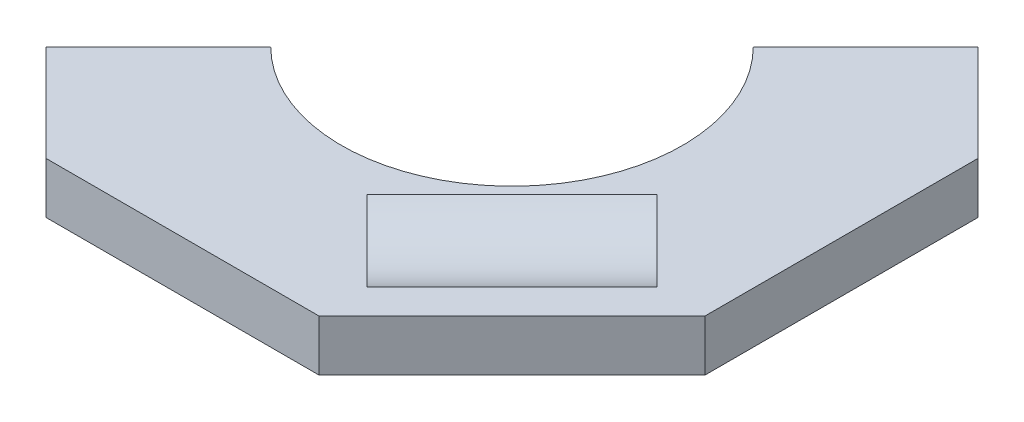
ISO-10303-21;
HEADER;
FILE_DESCRIPTION(('STEP AP214'),'2;1');
FILE_NAME('part.step','',(''),(''),'','','');
FILE_SCHEMA(('AUTOMOTIVE_DESIGN { 1 0 10303 214 1 1 1 1 }'));
ENDSEC;
DATA;
#1=APPLICATION_CONTEXT('core data for automotive mechanical design processes');
#2=APPLICATION_PROTOCOL_DEFINITION('international standard','automotive_design',2000,#1);
#3=PRODUCT_CONTEXT('',#1,'mechanical');
#4=PRODUCT('Part','Part','',(#3));
#5=PRODUCT_RELATED_PRODUCT_CATEGORY('part','',(#4));
#6=PRODUCT_DEFINITION_FORMATION('','',#4);
#7=PRODUCT_DEFINITION_CONTEXT('part definition',#1,'design');
#8=PRODUCT_DEFINITION('design','',#6,#7);
#9=PRODUCT_DEFINITION_SHAPE('','',#8);
#10=(LENGTH_UNIT() NAMED_UNIT(*) SI_UNIT(.MILLI.,.METRE.));
#11=(NAMED_UNIT(*) PLANE_ANGLE_UNIT() SI_UNIT($,.RADIAN.));
#12=(NAMED_UNIT(*) SI_UNIT($,.STERADIAN.) SOLID_ANGLE_UNIT());
#13=UNCERTAINTY_MEASURE_WITH_UNIT(LENGTH_MEASURE(1.E-05),#10,'distance_accuracy_value','');
#14=(GEOMETRIC_REPRESENTATION_CONTEXT(3) GLOBAL_UNCERTAINTY_ASSIGNED_CONTEXT((#13)) GLOBAL_UNIT_ASSIGNED_CONTEXT((#10,
#11,#12)) REPRESENTATION_CONTEXT('',''));
#15=CARTESIAN_POINT('',(0.,0.,0.));
#16=DIRECTION('',(0.,0.,1.));
#17=DIRECTION('',(1.,0.,0.));
#18=AXIS2_PLACEMENT_3D('',#15,#16,#17);
#19=CARTESIAN_POINT('',(-86.7210244842766,-0.00999999999999959,86.7210244842766));
#20=DIRECTION('',(0.707106781186547,0.,0.707106781186548));
#21=DIRECTION('',(0.707106781186548,0.,-0.707106781186547));
#22=AXIS2_PLACEMENT_3D('',#19,#20,#21);
#23=PLANE('',#22);
#24=DIRECTION('',(0.,1.,0.));
#25=VECTOR('',#24,1.);
#26=CARTESIAN_POINT('',(44.9012806053458,0.,-44.9012806053457));
#27=LINE('',#26,#25);
#28=CARTESIAN_POINT('',(44.9012806053458,19.05,-44.9012806053457));
#29=VERTEX_POINT('',#28);
#30=CARTESIAN_POINT('',(44.9012806053458,0.,-44.9012806053457));
#31=VERTEX_POINT('',#30);
#32=EDGE_CURVE('E138',#29,#31,#27,.F.);
#33=ORIENTED_EDGE('',*,*,#32,.F.);
#34=DIRECTION('',(0.707106781186548,0.,-0.707106781186547));
#35=VECTOR('',#34,1.);
#36=CARTESIAN_POINT('',(0.,19.05,0.));
#37=LINE('',#36,#35);
#38=CARTESIAN_POINT('',(86.7210244842766,19.05,-86.7210244842766));
#39=VERTEX_POINT('',#38);
#40=EDGE_CURVE('E116',#29,#39,#37,.T.);
#41=ORIENTED_EDGE('',*,*,#40,.T.);
#42=DIRECTION('',(0.,1.,0.));
#43=VECTOR('',#42,1.);
#44=CARTESIAN_POINT('',(86.7210244842766,19.05,-86.7210244842766));
#45=LINE('',#44,#43);
#46=CARTESIAN_POINT('',(86.7210244842766,0.,-86.7210244842766));
#47=VERTEX_POINT('',#46);
#48=EDGE_CURVE('E56',#47,#39,#45,.T.);
#49=ORIENTED_EDGE('',*,*,#48,.F.);
#50=DIRECTION('',(0.707106781186548,0.,-0.707106781186547));
#51=VECTOR('',#50,1.);
#52=CARTESIAN_POINT('',(0.,0.,0.));
#53=LINE('',#52,#51);
#54=EDGE_CURVE('E132',#31,#47,#53,.T.);
#55=ORIENTED_EDGE('',*,*,#54,.F.);
#56=EDGE_LOOP('',(#33,#41,#49,#55));
#57=FACE_BOUND('',#56,.T.);
#58=ADVANCED_FACE('F35',(#57),#23,.F.);
#59=DIRECTION('',(0.,-1.,0.));
#60=VECTOR('',#59,1.);
#61=CARTESIAN_POINT('',(-86.7210244842766,19.05,86.7210244842766));
#62=LINE('',#61,#60);
#63=CARTESIAN_POINT('',(-86.7210244842766,19.05,86.7210244842766));
#64=VERTEX_POINT('',#63);
#65=CARTESIAN_POINT('',(-86.7210244842766,0.,86.7210244842766));
#66=VERTEX_POINT('',#65);
#67=EDGE_CURVE('E131',#64,#66,#62,.T.);
#68=ORIENTED_EDGE('',*,*,#67,.F.);
#69=CARTESIAN_POINT('',(-44.9012806053458,19.05,44.9012806053458));
#70=VERTEX_POINT('',#69);
#71=EDGE_CURVE('E134',#64,#70,#37,.T.);
#72=ORIENTED_EDGE('',*,*,#71,.T.);
#73=DIRECTION('',(0.,1.,0.));
#74=VECTOR('',#73,1.);
#75=CARTESIAN_POINT('',(-44.9012806053458,0.,44.9012806053458));
#76=LINE('',#75,#74);
#77=CARTESIAN_POINT('',(-44.9012806053458,0.,44.9012806053458));
#78=VERTEX_POINT('',#77);
#79=EDGE_CURVE('E141',#78,#70,#76,.T.);
#80=ORIENTED_EDGE('',*,*,#79,.F.);
#81=EDGE_CURVE('E129',#66,#78,#53,.T.);
#82=ORIENTED_EDGE('',*,*,#81,.F.);
#83=EDGE_LOOP('',(#68,#72,#80,#82));
#84=FACE_BOUND('',#83,.T.);
#85=ADVANCED_FACE('F197',(#84),#23,.F.);
#86=CARTESIAN_POINT('',(-50.8,19.05,122.642048968553));
#87=DIRECTION('',(0.,0.,-1.));
#88=DIRECTION('',(-1.,0.,0.));
#89=AXIS2_PLACEMENT_3D('',#86,#87,#88);
#90=PLANE('',#89);
#91=DIRECTION('',(1.,0.,0.));
#92=VECTOR('',#91,1.);
#93=CARTESIAN_POINT('',(-50.8,0.,122.642048968553));
#94=LINE('',#93,#92);
#95=CARTESIAN_POINT('',(-50.8,0.,122.642048968553));
#96=VERTEX_POINT('',#95);
#97=CARTESIAN_POINT('',(50.8,0.,122.642048968553));
#98=VERTEX_POINT('',#97);
#99=EDGE_CURVE('E156',#96,#98,#94,.T.);
#100=ORIENTED_EDGE('',*,*,#99,.T.);
#101=DIRECTION('',(0.,-1.,0.));
#102=VECTOR('',#101,1.);
#103=CARTESIAN_POINT('',(50.8,19.05,122.642048968553));
#104=LINE('',#103,#102);
#105=CARTESIAN_POINT('',(50.8,19.05,122.642048968553));
#106=VERTEX_POINT('',#105);
#107=EDGE_CURVE('E152',#106,#98,#104,.T.);
#108=ORIENTED_EDGE('',*,*,#107,.F.);
#109=DIRECTION('',(1.,0.,0.));
#110=VECTOR('',#109,1.);
#111=CARTESIAN_POINT('',(-50.8,19.05,122.642048968553));
#112=LINE('',#111,#110);
#113=CARTESIAN_POINT('',(-50.8,19.05,122.642048968553));
#114=VERTEX_POINT('',#113);
#115=EDGE_CURVE('E155',#114,#106,#112,.T.);
#116=ORIENTED_EDGE('',*,*,#115,.F.);
#117=DIRECTION('',(0.,-1.,0.));
#118=VECTOR('',#117,1.);
#119=CARTESIAN_POINT('',(-50.8,19.05,122.642048968553));
#120=LINE('',#119,#118);
#121=EDGE_CURVE('E149',#114,#96,#120,.T.);
#122=ORIENTED_EDGE('',*,*,#121,.T.);
#123=EDGE_LOOP('',(#100,#108,#116,#122));
#124=FACE_BOUND('',#123,.T.);
#125=ADVANCED_FACE('F195',(#124),#90,.F.);
#126=CARTESIAN_POINT('',(50.8,19.05,122.642048968553));
#127=DIRECTION('',(-0.707106781186547,0.,-0.707106781186548));
#128=DIRECTION('',(-0.707106781186548,0.,0.707106781186547));
#129=AXIS2_PLACEMENT_3D('',#126,#127,#128);
#130=PLANE('',#129);
#131=DIRECTION('',(0.707106781186548,0.,-0.707106781186547));
#132=VECTOR('',#131,1.);
#133=CARTESIAN_POINT('',(50.8,0.,122.642048968553));
#134=LINE('',#133,#132);
#135=CARTESIAN_POINT('',(122.642048968553,0.,50.8000000000001));
#136=VERTEX_POINT('',#135);
#137=EDGE_CURVE('E165',#98,#136,#134,.T.);
#138=ORIENTED_EDGE('',*,*,#137,.T.);
#139=DIRECTION('',(0.,-1.,0.));
#140=VECTOR('',#139,1.);
#141=CARTESIAN_POINT('',(122.642048968553,19.05,50.8000000000001));
#142=LINE('',#141,#140);
#143=CARTESIAN_POINT('',(122.642048968553,19.05,50.8000000000001));
#144=VERTEX_POINT('',#143);
#145=EDGE_CURVE('E143',#144,#136,#142,.T.);
#146=ORIENTED_EDGE('',*,*,#145,.F.);
#147=DIRECTION('',(0.707106781186548,0.,-0.707106781186547));
#148=VECTOR('',#147,1.);
#149=CARTESIAN_POINT('',(50.8,19.05,122.642048968553));
#150=LINE('',#149,#148);
#151=EDGE_CURVE('E158',#106,#144,#150,.T.);
#152=ORIENTED_EDGE('',*,*,#151,.F.);
#153=ORIENTED_EDGE('',*,*,#107,.T.);
#154=EDGE_LOOP('',(#138,#146,#152,#153));
#155=FACE_BOUND('',#154,.T.);
#156=ADVANCED_FACE('F229',(#155),#130,.F.);
#157=CARTESIAN_POINT('',(122.642048968553,19.05,50.8000000000001));
#158=DIRECTION('',(-1.,0.,0.));
#159=DIRECTION('',(0.,0.,1.));
#160=AXIS2_PLACEMENT_3D('',#157,#158,#159);
#161=PLANE('',#160);
#162=DIRECTION('',(0.,0.,-1.));
#163=VECTOR('',#162,1.);
#164=CARTESIAN_POINT('',(122.642048968553,0.,50.8000000000001));
#165=LINE('',#164,#163);
#166=CARTESIAN_POINT('',(122.642048968553,0.,-50.8));
#167=VERTEX_POINT('',#166);
#168=EDGE_CURVE('E163',#136,#167,#165,.T.);
#169=ORIENTED_EDGE('',*,*,#168,.T.);
#170=DIRECTION('',(0.,-1.,0.));
#171=VECTOR('',#170,1.);
#172=CARTESIAN_POINT('',(122.642048968553,19.05,-50.8));
#173=LINE('',#172,#171);
#174=CARTESIAN_POINT('',(122.642048968553,19.05,-50.8));
#175=VERTEX_POINT('',#174);
#176=EDGE_CURVE('E146',#175,#167,#173,.T.);
#177=ORIENTED_EDGE('',*,*,#176,.F.);
#178=DIRECTION('',(0.,0.,-1.));
#179=VECTOR('',#178,1.);
#180=CARTESIAN_POINT('',(122.642048968553,19.05,50.8000000000001));
#181=LINE('',#180,#179);
#182=EDGE_CURVE('E175',#144,#175,#181,.T.);
#183=ORIENTED_EDGE('',*,*,#182,.F.);
#184=ORIENTED_EDGE('',*,*,#145,.T.);
#185=EDGE_LOOP('',(#169,#177,#183,#184));
#186=FACE_BOUND('',#185,.T.);
#187=ADVANCED_FACE('F230',(#186),#161,.F.);
#188=CARTESIAN_POINT('',(122.642048968553,19.05,-50.8));
#189=DIRECTION('',(-0.707106781186548,0.,0.707106781186547));
#190=DIRECTION('',(0.707106781186547,0.,0.707106781186548));
#191=AXIS2_PLACEMENT_3D('',#188,#189,#190);
#192=PLANE('',#191);
#193=DIRECTION('',(-0.707106781186547,0.,-0.707106781186548));
#194=VECTOR('',#193,1.);
#195=CARTESIAN_POINT('',(122.642048968553,0.,-50.8));
#196=LINE('',#195,#194);
#197=EDGE_CURVE('E161',#167,#47,#196,.T.);
#198=ORIENTED_EDGE('',*,*,#197,.T.);
#199=ORIENTED_EDGE('',*,*,#48,.T.);
#200=DIRECTION('',(-0.707106781186547,0.,-0.707106781186548));
#201=VECTOR('',#200,1.);
#202=CARTESIAN_POINT('',(122.642048968553,19.05,-50.8));
#203=LINE('',#202,#201);
#204=EDGE_CURVE('E172',#175,#39,#203,.T.);
#205=ORIENTED_EDGE('',*,*,#204,.F.);
#206=ORIENTED_EDGE('',*,*,#176,.T.);
#207=EDGE_LOOP('',(#198,#199,#205,#206));
#208=FACE_BOUND('',#207,.T.);
#209=ADVANCED_FACE('F211',(#208),#192,.F.);
#210=CARTESIAN_POINT('',(-122.642048968553,19.05,50.7999999999999));
#211=DIRECTION('',(0.707106781186548,0.,-0.707106781186547));
#212=DIRECTION('',(-0.707106781186547,0.,-0.707106781186548));
#213=AXIS2_PLACEMENT_3D('',#210,#211,#212);
#214=PLANE('',#213);
#215=DIRECTION('',(0.707106781186547,0.,0.707106781186548));
#216=VECTOR('',#215,1.);
#217=CARTESIAN_POINT('',(-122.642048968553,19.05,50.7999999999999));
#218=LINE('',#217,#216);
#219=EDGE_CURVE('E170',#64,#114,#218,.T.);
#220=ORIENTED_EDGE('',*,*,#219,.F.);
#221=ORIENTED_EDGE('',*,*,#67,.T.);
#222=DIRECTION('',(0.707106781186547,0.,0.707106781186548));
#223=VECTOR('',#222,1.);
#224=CARTESIAN_POINT('',(-122.642048968553,0.,50.7999999999999));
#225=LINE('',#224,#223);
#226=EDGE_CURVE('E159',#66,#96,#225,.T.);
#227=ORIENTED_EDGE('',*,*,#226,.T.);
#228=ORIENTED_EDGE('',*,*,#121,.F.);
#229=EDGE_LOOP('',(#220,#221,#227,#228));
#230=FACE_BOUND('',#229,.T.);
#231=ADVANCED_FACE('F222',(#230),#214,.F.);
#232=CARTESIAN_POINT('',(0.,0.,0.));
#233=DIRECTION('',(0.,1.,0.));
#234=DIRECTION('',(0.,0.,1.));
#235=AXIS2_PLACEMENT_3D('',#232,#233,#234);
#236=PLANE('',#235);
#237=ORIENTED_EDGE('',*,*,#226,.F.);
#238=ORIENTED_EDGE('',*,*,#81,.T.);
#239=CARTESIAN_POINT('',(0.,0.,0.));
#240=DIRECTION('',(0.,1.,0.));
#241=DIRECTION('',(0.,0.,1.));
#242=AXIS2_PLACEMENT_3D('',#239,#240,#241);
#243=CIRCLE('',#242,63.5);
#244=EDGE_CURVE('E168',#78,#31,#243,.T.);
#245=ORIENTED_EDGE('',*,*,#244,.T.);
#246=ORIENTED_EDGE('',*,*,#54,.T.);
#247=ORIENTED_EDGE('',*,*,#197,.F.);
#248=ORIENTED_EDGE('',*,*,#168,.F.);
#249=ORIENTED_EDGE('',*,*,#137,.F.);
#250=ORIENTED_EDGE('',*,*,#99,.F.);
#251=EDGE_LOOP('',(#237,#238,#245,#246,#247,#248,#249,#250));
#252=FACE_BOUND('',#251,.T.);
#253=ADVANCED_FACE('F216',(#252),#236,.F.);
#254=CARTESIAN_POINT('',(0.,19.05,0.));
#255=DIRECTION('',(0.,1.,0.));
#256=DIRECTION('',(0.,0.,1.));
#257=AXIS2_PLACEMENT_3D('',#254,#255,#256);
#258=PLANE('',#257);
#259=DIRECTION('',(-0.707106781186547,0.,-0.707106781186548));
#260=VECTOR('',#259,1.);
#261=CARTESIAN_POINT('',(26.9407683632075,19.05,-26.9407683632075));
#262=LINE('',#261,#260);
#263=CARTESIAN_POINT('',(104.340978597997,19.05,50.4594418715823));
#264=VERTEX_POINT('',#263);
#265=CARTESIAN_POINT('',(74.4892240431975,19.05,20.6076873167826));
#266=VERTEX_POINT('',#265);
#267=EDGE_CURVE('E11',#264,#266,#262,.T.);
#268=ORIENTED_EDGE('',*,*,#267,.F.);
#269=DIRECTION('',(-0.707106781186548,0.,0.707106781186547));
#270=VECTOR('',#269,1.);
#271=CARTESIAN_POINT('',(104.340978597997,19.05,50.4594418715823));
#272=LINE('',#271,#270);
#273=CARTESIAN_POINT('',(50.4594418715822,19.05,104.340978597997));
#274=VERTEX_POINT('',#273);
#275=EDGE_CURVE('E115',#264,#274,#272,.T.);
#276=ORIENTED_EDGE('',*,*,#275,.T.);
#277=DIRECTION('',(-0.707106781186547,0.,-0.707106781186548));
#278=VECTOR('',#277,1.);
#279=CARTESIAN_POINT('',(-26.9407683632075,19.05,26.9407683632075));
#280=LINE('',#279,#278);
#281=CARTESIAN_POINT('',(20.6076873167826,19.05,74.4892240431975));
#282=VERTEX_POINT('',#281);
#283=EDGE_CURVE('E110',#274,#282,#280,.T.);
#284=ORIENTED_EDGE('',*,*,#283,.T.);
#285=DIRECTION('',(-0.707106781186548,0.,0.707106781186547));
#286=VECTOR('',#285,1.);
#287=CARTESIAN_POINT('',(74.4892240431975,19.05,20.6076873167826));
#288=LINE('',#287,#286);
#289=EDGE_CURVE('E42',#282,#266,#288,.F.);
#290=ORIENTED_EDGE('',*,*,#289,.T.);
#291=EDGE_LOOP('',(#268,#276,#284,#290));
#292=FACE_BOUND('',#291,.T.);
#293=ORIENTED_EDGE('',*,*,#71,.F.);
#294=ORIENTED_EDGE('',*,*,#219,.T.);
#295=ORIENTED_EDGE('',*,*,#115,.T.);
#296=ORIENTED_EDGE('',*,*,#151,.T.);
#297=ORIENTED_EDGE('',*,*,#182,.T.);
#298=ORIENTED_EDGE('',*,*,#204,.T.);
#299=ORIENTED_EDGE('',*,*,#40,.F.);
#300=CARTESIAN_POINT('',(0.,19.05,0.));
#301=DIRECTION('',(0.,1.,0.));
#302=DIRECTION('',(0.,0.,1.));
#303=AXIS2_PLACEMENT_3D('',#300,#301,#302);
#304=CIRCLE('',#303,63.5);
#305=EDGE_CURVE('E179',#70,#29,#304,.T.);
#306=ORIENTED_EDGE('',*,*,#305,.F.);
#307=EDGE_LOOP('',(#293,#294,#295,#296,#297,#298,#299,#306));
#308=FACE_BOUND('',#307,.T.);
#309=ADVANCED_FACE('F125',(#292,#308),#258,.T.);
#310=CARTESIAN_POINT('',(0.,0.,0.));
#311=DIRECTION('',(0.,1.,0.));
#312=DIRECTION('',(0.,0.,1.));
#313=AXIS2_PLACEMENT_3D('',#310,#311,#312);
#314=CYLINDRICAL_SURFACE('',#313,63.5);
#315=ORIENTED_EDGE('',*,*,#305,.T.);
#316=ORIENTED_EDGE('',*,*,#32,.T.);
#317=ORIENTED_EDGE('',*,*,#244,.F.);
#318=ORIENTED_EDGE('',*,*,#79,.T.);
#319=EDGE_LOOP('',(#315,#316,#317,#318));
#320=FACE_BOUND('',#319,.T.);
#321=ADVANCED_FACE('F193',(#320),#314,.F.);
#322=CARTESIAN_POINT('',(89.4151013205973,41.91,35.5335645941824));
#323=DIRECTION('',(-0.707106781186548,0.,0.707106781186547));
#324=DIRECTION('',(0.707106781186547,0.,0.707106781186548));
#325=AXIS2_PLACEMENT_3D('',#322,#323,#324);
#326=CYLINDRICAL_SURFACE('',#325,31.115);
#327=CARTESIAN_POINT('',(35.5335645941824,41.91,89.4151013205974));
#328=DIRECTION('',(0.707106781186548,0.,-0.707106781186547));
#329=DIRECTION('',(-0.707106781186547,0.,-0.707106781186548));
#330=AXIS2_PLACEMENT_3D('',#327,#328,#329);
#331=CIRCLE('',#330,31.115);
#332=EDGE_CURVE('E48',#274,#282,#331,.T.);
#333=ORIENTED_EDGE('',*,*,#332,.F.);
#334=ORIENTED_EDGE('',*,*,#275,.F.);
#335=CARTESIAN_POINT('',(89.4151013205973,41.91,35.5335645941824));
#336=DIRECTION('',(0.707106781186548,0.,-0.707106781186547));
#337=DIRECTION('',(-0.707106781186547,0.,-0.707106781186548));
#338=AXIS2_PLACEMENT_3D('',#335,#336,#337);
#339=CIRCLE('',#338,31.115);
#340=EDGE_CURVE('E122',#264,#266,#339,.T.);
#341=ORIENTED_EDGE('',*,*,#340,.T.);
#342=ORIENTED_EDGE('',*,*,#289,.F.);
#343=EDGE_LOOP('',(#333,#334,#341,#342));
#344=FACE_BOUND('',#343,.T.);
#345=ADVANCED_FACE('F119',(#344),#326,.F.);
#346=CARTESIAN_POINT('',(89.4151013205973,41.91,35.5335645941824));
#347=DIRECTION('',(0.707106781186548,0.,-0.707106781186547));
#348=DIRECTION('',(-0.707106781186547,0.,-0.707106781186548));
#349=AXIS2_PLACEMENT_3D('',#346,#347,#348);
#350=PLANE('',#349);
#351=ORIENTED_EDGE('',*,*,#267,.T.);
#352=ORIENTED_EDGE('',*,*,#340,.F.);
#353=EDGE_LOOP('',(#351,#352));
#354=FACE_BOUND('',#353,.T.);
#355=ADVANCED_FACE('F185',(#354),#350,.F.);
#356=CARTESIAN_POINT('',(35.5335645941824,41.91,89.4151013205974));
#357=DIRECTION('',(0.707106781186548,0.,-0.707106781186547));
#358=DIRECTION('',(-0.707106781186547,0.,-0.707106781186548));
#359=AXIS2_PLACEMENT_3D('',#356,#357,#358);
#360=PLANE('',#359);
#361=ORIENTED_EDGE('',*,*,#332,.T.);
#362=ORIENTED_EDGE('',*,*,#283,.F.);
#363=EDGE_LOOP('',(#361,#362));
#364=FACE_BOUND('',#363,.T.);
#365=ADVANCED_FACE('F111',(#364),#360,.T.);
#366=CLOSED_SHELL('',(#58,#85,#125,#156,#187,#209,#231,#253,#309,#321,#345,#355,#365));
#367=MANIFOLD_SOLID_BREP('B2',#366);
#368=ADVANCED_BREP_SHAPE_REPRESENTATION('',(#18,#367),#14);
#369=SHAPE_DEFINITION_REPRESENTATION(#9,#368);
ENDSEC;
END-ISO-10303-21;
